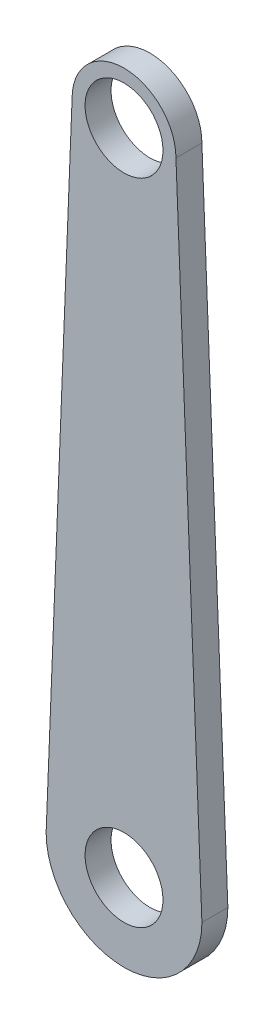
ISO-10303-21;
HEADER;
FILE_DESCRIPTION(('STEP AP214'),'2;1');
FILE_NAME('part.step','',(''),(''),'','','');
FILE_SCHEMA(('AUTOMOTIVE_DESIGN { 1 0 10303 214 1 1 1 1 }'));
ENDSEC;
DATA;
#1=APPLICATION_CONTEXT('core data for automotive mechanical design processes');
#2=APPLICATION_PROTOCOL_DEFINITION('international standard','automotive_design',2000,#1);
#3=PRODUCT_CONTEXT('',#1,'mechanical');
#4=PRODUCT('Part','Part','',(#3));
#5=PRODUCT_RELATED_PRODUCT_CATEGORY('part','',(#4));
#6=PRODUCT_DEFINITION_FORMATION('','',#4);
#7=PRODUCT_DEFINITION_CONTEXT('part definition',#1,'design');
#8=PRODUCT_DEFINITION('design','',#6,#7);
#9=PRODUCT_DEFINITION_SHAPE('','',#8);
#10=(LENGTH_UNIT() NAMED_UNIT(*) SI_UNIT(.MILLI.,.METRE.));
#11=(NAMED_UNIT(*) PLANE_ANGLE_UNIT() SI_UNIT($,.RADIAN.));
#12=(NAMED_UNIT(*) SI_UNIT($,.STERADIAN.) SOLID_ANGLE_UNIT());
#13=UNCERTAINTY_MEASURE_WITH_UNIT(LENGTH_MEASURE(1.E-05),#10,'distance_accuracy_value','');
#14=(GEOMETRIC_REPRESENTATION_CONTEXT(3) GLOBAL_UNCERTAINTY_ASSIGNED_CONTEXT((#13)) GLOBAL_UNIT_ASSIGNED_CONTEXT((#10,
#11,#12)) REPRESENTATION_CONTEXT('',''));
#15=CARTESIAN_POINT('',(0.,0.,0.));
#16=DIRECTION('',(0.,0.,1.));
#17=DIRECTION('',(1.,0.,0.));
#18=AXIS2_PLACEMENT_3D('',#15,#16,#17);
#19=CARTESIAN_POINT('',(8.07772589112119,-0.323109035644848,2.));
#20=DIRECTION('',(0.999200958721789,-0.0399680383488716,0.));
#21=DIRECTION('',(0.0399680383488716,0.999200958721789,0.));
#22=AXIS2_PLACEMENT_3D('',#19,#20,#21);
#23=PLANE('',#22);
#24=DIRECTION('',(-0.0399680383488716,-0.99920095872179,0.));
#25=VECTOR('',#24,1.);
#26=CARTESIAN_POINT('',(8.07772589112119,-0.323109035644848,0.));
#27=LINE('',#26,#25);
#28=CARTESIAN_POINT('',(8.69089530054577,15.0061261999696,0.));
#29=VERTEX_POINT('',#28);
#30=CARTESIAN_POINT('',(6.69089530054577,-34.9938738000304,0.));
#31=VERTEX_POINT('',#30);
#32=EDGE_CURVE('E106',#29,#31,#27,.T.);
#33=ORIENTED_EDGE('',*,*,#32,.T.);
#34=DIRECTION('',(0.,0.,-1.));
#35=VECTOR('',#34,1.);
#36=CARTESIAN_POINT('',(6.69089530054577,-34.9938738000304,2.));
#37=LINE('',#36,#35);
#38=CARTESIAN_POINT('',(6.69089530054577,-34.9938738000304,2.));
#39=VERTEX_POINT('',#38);
#40=EDGE_CURVE('E11',#39,#31,#37,.T.);
#41=ORIENTED_EDGE('',*,*,#40,.F.);
#42=DIRECTION('',(-0.0399680383488716,-0.99920095872179,0.));
#43=VECTOR('',#42,1.);
#44=CARTESIAN_POINT('',(8.07772589112119,-0.323109035644848,2.));
#45=LINE('',#44,#43);
#46=CARTESIAN_POINT('',(8.69089530054577,15.0061261999696,2.));
#47=VERTEX_POINT('',#46);
#48=EDGE_CURVE('E85',#47,#39,#45,.T.);
#49=ORIENTED_EDGE('',*,*,#48,.F.);
#50=DIRECTION('',(0.,0.,-1.));
#51=VECTOR('',#50,1.);
#52=CARTESIAN_POINT('',(8.69089530054577,15.0061261999696,2.));
#53=LINE('',#52,#51);
#54=EDGE_CURVE('E96',#47,#29,#53,.T.);
#55=ORIENTED_EDGE('',*,*,#54,.T.);
#56=EDGE_LOOP('',(#33,#41,#49,#55));
#57=FACE_BOUND('',#56,.T.);
#58=ADVANCED_FACE('F37',(#57),#23,.F.);
#59=CARTESIAN_POINT('',(12.6908953005458,-34.9938738000304,2.));
#60=DIRECTION('',(0.,0.,-1.));
#61=DIRECTION('',(-1.,0.,0.));
#62=AXIS2_PLACEMENT_3D('',#59,#60,#61);
#63=CYLINDRICAL_SURFACE('',#62,6.);
#64=CARTESIAN_POINT('',(12.6908953005458,-34.9938738000304,0.));
#65=DIRECTION('',(0.,0.,1.));
#66=DIRECTION('',(1.,0.,0.));
#67=AXIS2_PLACEMENT_3D('',#64,#65,#66);
#68=CIRCLE('',#67,6.);
#69=CARTESIAN_POINT('',(18.6908953005458,-34.9938738000304,0.));
#70=VERTEX_POINT('',#69);
#71=EDGE_CURVE('E90',#31,#70,#68,.T.);
#72=ORIENTED_EDGE('',*,*,#71,.T.);
#73=DIRECTION('',(0.,0.,-1.));
#74=VECTOR('',#73,1.);
#75=CARTESIAN_POINT('',(18.6908953005458,-34.9938738000304,2.));
#76=LINE('',#75,#74);
#77=CARTESIAN_POINT('',(18.6908953005458,-34.9938738000304,2.));
#78=VERTEX_POINT('',#77);
#79=EDGE_CURVE('E46',#78,#70,#76,.T.);
#80=ORIENTED_EDGE('',*,*,#79,.F.);
#81=CARTESIAN_POINT('',(12.6908953005458,-34.9938738000304,2.));
#82=DIRECTION('',(0.,0.,1.));
#83=DIRECTION('',(1.,0.,0.));
#84=AXIS2_PLACEMENT_3D('',#81,#82,#83);
#85=CIRCLE('',#84,6.);
#86=EDGE_CURVE('E80',#39,#78,#85,.T.);
#87=ORIENTED_EDGE('',*,*,#86,.F.);
#88=ORIENTED_EDGE('',*,*,#40,.T.);
#89=EDGE_LOOP('',(#72,#80,#87,#88));
#90=FACE_BOUND('',#89,.T.);
#91=ADVANCED_FACE('F89',(#90),#63,.T.);
#92=CARTESIAN_POINT('',(17.2635187185948,0.690540748743791,2.));
#93=DIRECTION('',(0.999200958721789,0.0399680383488715,0.));
#94=DIRECTION('',(-0.0399680383488715,0.999200958721789,0.));
#95=AXIS2_PLACEMENT_3D('',#92,#93,#94);
#96=PLANE('',#95);
#97=DIRECTION('',(0.0399680383488715,-0.99920095872179,0.));
#98=VECTOR('',#97,1.);
#99=CARTESIAN_POINT('',(17.2635187185948,0.690540748743791,0.));
#100=LINE('',#99,#98);
#101=CARTESIAN_POINT('',(16.6908953005458,15.0061261999696,0.));
#102=VERTEX_POINT('',#101);
#103=EDGE_CURVE('E110',#102,#70,#100,.T.);
#104=ORIENTED_EDGE('',*,*,#103,.F.);
#105=DIRECTION('',(0.,0.,-1.));
#106=VECTOR('',#105,1.);
#107=CARTESIAN_POINT('',(16.6908953005458,15.0061261999696,2.));
#108=LINE('',#107,#106);
#109=CARTESIAN_POINT('',(16.6908953005458,15.0061261999696,2.));
#110=VERTEX_POINT('',#109);
#111=EDGE_CURVE('E70',#110,#102,#108,.T.);
#112=ORIENTED_EDGE('',*,*,#111,.F.);
#113=DIRECTION('',(0.0399680383488715,-0.99920095872179,0.));
#114=VECTOR('',#113,1.);
#115=CARTESIAN_POINT('',(17.2635187185948,0.690540748743791,2.));
#116=LINE('',#115,#114);
#117=EDGE_CURVE('E83',#110,#78,#116,.T.);
#118=ORIENTED_EDGE('',*,*,#117,.T.);
#119=ORIENTED_EDGE('',*,*,#79,.T.);
#120=EDGE_LOOP('',(#104,#112,#118,#119));
#121=FACE_BOUND('',#120,.T.);
#122=ADVANCED_FACE('F94',(#121),#96,.T.);
#123=CARTESIAN_POINT('',(12.6908953005458,-34.9938738000304,2.));
#124=DIRECTION('',(0.,0.,-1.));
#125=DIRECTION('',(-1.,0.,0.));
#126=AXIS2_PLACEMENT_3D('',#123,#124,#125);
#127=CYLINDRICAL_SURFACE('',#126,3.);
#128=CARTESIAN_POINT('',(12.6908953005458,-34.9938738000304,2.));
#129=DIRECTION('',(0.,0.,1.));
#130=DIRECTION('',(1.,0.,0.));
#131=AXIS2_PLACEMENT_3D('',#128,#129,#130);
#132=CIRCLE('',#131,3.);
#133=CARTESIAN_POINT('',(15.6908953005458,-34.9938738000304,2.));
#134=VERTEX_POINT('',#133);
#135=EDGE_CURVE('E148',#134,#134,#132,.T.);
#136=ORIENTED_EDGE('',*,*,#135,.T.);
#137=EDGE_LOOP('',(#136));
#138=FACE_BOUND('',#137,.T.);
#139=CARTESIAN_POINT('',(12.6908953005458,-34.9938738000304,0.));
#140=DIRECTION('',(0.,0.,1.));
#141=DIRECTION('',(1.,0.,0.));
#142=AXIS2_PLACEMENT_3D('',#139,#140,#141);
#143=CIRCLE('',#142,3.);
#144=CARTESIAN_POINT('',(15.6908953005458,-34.9938738000304,0.));
#145=VERTEX_POINT('',#144);
#146=EDGE_CURVE('E103',#145,#145,#143,.T.);
#147=ORIENTED_EDGE('',*,*,#146,.F.);
#148=EDGE_LOOP('',(#147));
#149=FACE_BOUND('',#148,.T.);
#150=ADVANCED_FACE('F137',(#138,#149),#127,.F.);
#151=CARTESIAN_POINT('',(12.6908953005458,15.0061261999696,2.));
#152=DIRECTION('',(0.,0.,-1.));
#153=DIRECTION('',(-1.,0.,0.));
#154=AXIS2_PLACEMENT_3D('',#151,#152,#153);
#155=CYLINDRICAL_SURFACE('',#154,3.);
#156=CARTESIAN_POINT('',(12.6908953005458,15.0061261999696,2.));
#157=DIRECTION('',(0.,0.,1.));
#158=DIRECTION('',(1.,0.,0.));
#159=AXIS2_PLACEMENT_3D('',#156,#157,#158);
#160=CIRCLE('',#159,3.);
#161=CARTESIAN_POINT('',(15.6908953005458,15.0061261999696,2.));
#162=VERTEX_POINT('',#161);
#163=EDGE_CURVE('E113',#162,#162,#160,.T.);
#164=ORIENTED_EDGE('',*,*,#163,.T.);
#165=EDGE_LOOP('',(#164));
#166=FACE_BOUND('',#165,.T.);
#167=CARTESIAN_POINT('',(12.6908953005458,15.0061261999696,0.));
#168=DIRECTION('',(0.,0.,1.));
#169=DIRECTION('',(1.,0.,0.));
#170=AXIS2_PLACEMENT_3D('',#167,#168,#169);
#171=CIRCLE('',#170,3.);
#172=CARTESIAN_POINT('',(15.6908953005458,15.0061261999696,0.));
#173=VERTEX_POINT('',#172);
#174=EDGE_CURVE('E100',#173,#173,#171,.T.);
#175=ORIENTED_EDGE('',*,*,#174,.F.);
#176=EDGE_LOOP('',(#175));
#177=FACE_BOUND('',#176,.T.);
#178=ADVANCED_FACE('F39',(#166,#177),#155,.F.);
#179=CARTESIAN_POINT('',(12.6908953005458,15.0061261999696,2.));
#180=DIRECTION('',(0.,0.,-1.));
#181=DIRECTION('',(-1.,0.,0.));
#182=AXIS2_PLACEMENT_3D('',#179,#180,#181);
#183=CYLINDRICAL_SURFACE('',#182,4.);
#184=CARTESIAN_POINT('',(12.6908953005458,15.0061261999696,0.));
#185=DIRECTION('',(0.,0.,1.));
#186=DIRECTION('',(1.,0.,0.));
#187=AXIS2_PLACEMENT_3D('',#184,#185,#186);
#188=CIRCLE('',#187,4.);
#189=EDGE_CURVE('E73',#102,#29,#188,.T.);
#190=ORIENTED_EDGE('',*,*,#189,.T.);
#191=ORIENTED_EDGE('',*,*,#54,.F.);
#192=CARTESIAN_POINT('',(12.6908953005458,15.0061261999696,2.));
#193=DIRECTION('',(0.,0.,1.));
#194=DIRECTION('',(1.,0.,0.));
#195=AXIS2_PLACEMENT_3D('',#192,#193,#194);
#196=CIRCLE('',#195,4.);
#197=EDGE_CURVE('E54',#110,#47,#196,.T.);
#198=ORIENTED_EDGE('',*,*,#197,.F.);
#199=ORIENTED_EDGE('',*,*,#111,.T.);
#200=EDGE_LOOP('',(#190,#191,#198,#199));
#201=FACE_BOUND('',#200,.T.);
#202=ADVANCED_FACE('F125',(#201),#183,.T.);
#203=CARTESIAN_POINT('',(0.,0.,2.));
#204=DIRECTION('',(0.,0.,1.));
#205=DIRECTION('',(1.,0.,0.));
#206=AXIS2_PLACEMENT_3D('',#203,#204,#205);
#207=PLANE('',#206);
#208=ORIENTED_EDGE('',*,*,#163,.F.);
#209=EDGE_LOOP('',(#208));
#210=FACE_BOUND('',#209,.T.);
#211=ORIENTED_EDGE('',*,*,#135,.F.);
#212=EDGE_LOOP('',(#211));
#213=FACE_BOUND('',#212,.T.);
#214=ORIENTED_EDGE('',*,*,#48,.T.);
#215=ORIENTED_EDGE('',*,*,#86,.T.);
#216=ORIENTED_EDGE('',*,*,#117,.F.);
#217=ORIENTED_EDGE('',*,*,#197,.T.);
#218=EDGE_LOOP('',(#214,#215,#216,#217));
#219=FACE_BOUND('',#218,.T.);
#220=ADVANCED_FACE('F81',(#210,#213,#219),#207,.T.);
#221=CARTESIAN_POINT('',(0.,0.,0.));
#222=DIRECTION('',(0.,0.,1.));
#223=DIRECTION('',(1.,0.,0.));
#224=AXIS2_PLACEMENT_3D('',#221,#222,#223);
#225=PLANE('',#224);
#226=ORIENTED_EDGE('',*,*,#174,.T.);
#227=EDGE_LOOP('',(#226));
#228=FACE_BOUND('',#227,.T.);
#229=ORIENTED_EDGE('',*,*,#146,.T.);
#230=EDGE_LOOP('',(#229));
#231=FACE_BOUND('',#230,.T.);
#232=ORIENTED_EDGE('',*,*,#32,.F.);
#233=ORIENTED_EDGE('',*,*,#189,.F.);
#234=ORIENTED_EDGE('',*,*,#103,.T.);
#235=ORIENTED_EDGE('',*,*,#71,.F.);
#236=EDGE_LOOP('',(#232,#233,#234,#235));
#237=FACE_BOUND('',#236,.T.);
#238=ADVANCED_FACE('F118',(#228,#231,#237),#225,.F.);
#239=CLOSED_SHELL('',(#58,#91,#122,#150,#178,#202,#220,#238));
#240=MANIFOLD_SOLID_BREP('B2',#239);
#241=ADVANCED_BREP_SHAPE_REPRESENTATION('',(#18,#240),#14);
#242=SHAPE_DEFINITION_REPRESENTATION(#9,#241);
ENDSEC;
END-ISO-10303-21;
